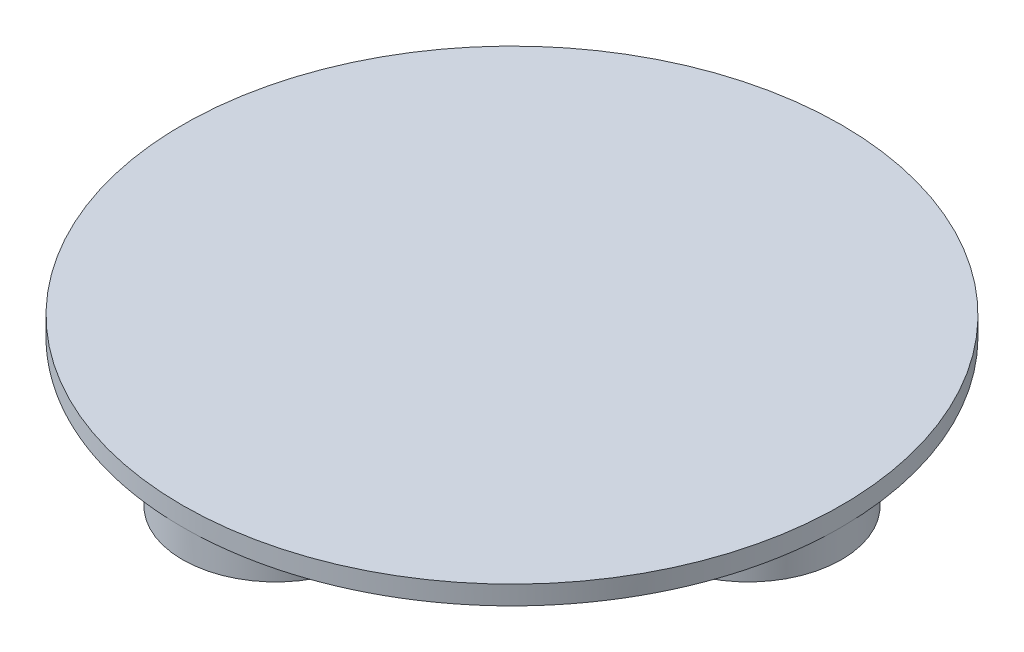
ISO-10303-21;
HEADER;
FILE_DESCRIPTION(('STEP AP214'),'2;1');
FILE_NAME('part.step','',(''),(''),'','','');
FILE_SCHEMA(('AUTOMOTIVE_DESIGN { 1 0 10303 214 1 1 1 1 }'));
ENDSEC;
DATA;
#1=APPLICATION_CONTEXT('core data for automotive mechanical design processes');
#2=APPLICATION_PROTOCOL_DEFINITION('international standard','automotive_design',2000,#1);
#3=PRODUCT_CONTEXT('',#1,'mechanical');
#4=PRODUCT('Part','Part','',(#3));
#5=PRODUCT_RELATED_PRODUCT_CATEGORY('part','',(#4));
#6=PRODUCT_DEFINITION_FORMATION('','',#4);
#7=PRODUCT_DEFINITION_CONTEXT('part definition',#1,'design');
#8=PRODUCT_DEFINITION('design','',#6,#7);
#9=PRODUCT_DEFINITION_SHAPE('','',#8);
#10=(LENGTH_UNIT() NAMED_UNIT(*) SI_UNIT(.MILLI.,.METRE.));
#11=(NAMED_UNIT(*) PLANE_ANGLE_UNIT() SI_UNIT($,.RADIAN.));
#12=(NAMED_UNIT(*) SI_UNIT($,.STERADIAN.) SOLID_ANGLE_UNIT());
#13=UNCERTAINTY_MEASURE_WITH_UNIT(LENGTH_MEASURE(1.E-05),#10,'distance_accuracy_value','');
#14=(GEOMETRIC_REPRESENTATION_CONTEXT(3) GLOBAL_UNCERTAINTY_ASSIGNED_CONTEXT((#13)) GLOBAL_UNIT_ASSIGNED_CONTEXT((#10,
#11,#12)) REPRESENTATION_CONTEXT('',''));
#15=CARTESIAN_POINT('',(0.,0.,0.));
#16=DIRECTION('',(0.,0.,1.));
#17=DIRECTION('',(1.,0.,0.));
#18=AXIS2_PLACEMENT_3D('',#15,#16,#17);
#19=CARTESIAN_POINT('',(0.,2.,0.));
#20=DIRECTION('',(0.,-1.,0.));
#21=DIRECTION('',(0.,0.,-1.));
#22=AXIS2_PLACEMENT_3D('',#19,#20,#21);
#23=CYLINDRICAL_SURFACE('',#22,35.);
#24=CARTESIAN_POINT('',(0.,2.,0.));
#25=DIRECTION('',(0.,1.,0.));
#26=DIRECTION('',(0.,0.,1.));
#27=AXIS2_PLACEMENT_3D('',#24,#25,#26);
#28=CIRCLE('',#27,35.);
#29=CARTESIAN_POINT('',(0.,2.,35.));
#30=VERTEX_POINT('',#29);
#31=EDGE_CURVE('E11',#30,#30,#28,.T.);
#32=ORIENTED_EDGE('',*,*,#31,.F.);
#33=EDGE_LOOP('',(#32));
#34=FACE_BOUND('',#33,.T.);
#35=CARTESIAN_POINT('',(0.,0.,0.));
#36=DIRECTION('',(0.,1.,0.));
#37=DIRECTION('',(0.,0.,1.));
#38=AXIS2_PLACEMENT_3D('',#35,#36,#37);
#39=CIRCLE('',#38,35.);
#40=CARTESIAN_POINT('',(35.,0.,0.));
#41=VERTEX_POINT('',#40);
#42=CARTESIAN_POINT('',(0.,0.,-35.));
#43=VERTEX_POINT('',#42);
#44=EDGE_CURVE('E40',#41,#43,#39,.T.);
#45=ORIENTED_EDGE('',*,*,#44,.T.);
#46=CARTESIAN_POINT('',(-35.,0.,0.));
#47=VERTEX_POINT('',#46);
#48=EDGE_CURVE('E61',#43,#47,#39,.T.);
#49=ORIENTED_EDGE('',*,*,#48,.T.);
#50=CARTESIAN_POINT('',(0.,0.,35.));
#51=VERTEX_POINT('',#50);
#52=EDGE_CURVE('E60',#47,#51,#39,.T.);
#53=ORIENTED_EDGE('',*,*,#52,.T.);
#54=EDGE_CURVE('E51',#51,#41,#39,.T.);
#55=ORIENTED_EDGE('',*,*,#54,.T.);
#56=EDGE_LOOP('',(#45,#49,#53,#55));
#57=FACE_BOUND('',#56,.T.);
#58=ADVANCED_FACE('F37',(#34,#57),#23,.T.);
#59=CARTESIAN_POINT('',(0.,2.,0.));
#60=DIRECTION('',(0.,1.,0.));
#61=DIRECTION('',(0.,0.,1.));
#62=AXIS2_PLACEMENT_3D('',#59,#60,#61);
#63=PLANE('',#62);
#64=ORIENTED_EDGE('',*,*,#31,.T.);
#65=EDGE_LOOP('',(#64));
#66=FACE_BOUND('',#65,.T.);
#67=ADVANCED_FACE('F111',(#66),#63,.T.);
#68=CARTESIAN_POINT('',(0.,0.,0.));
#69=DIRECTION('',(0.,1.,0.));
#70=DIRECTION('',(0.,0.,1.));
#71=AXIS2_PLACEMENT_3D('',#68,#69,#70);
#72=PLANE('',#71);
#73=ORIENTED_EDGE('',*,*,#54,.F.);
#74=CARTESIAN_POINT('',(0.,0.,25.1));
#75=DIRECTION('',(0.,-1.,0.));
#76=DIRECTION('',(0.,0.,-1.));
#77=AXIS2_PLACEMENT_3D('',#74,#75,#76);
#78=CIRCLE('',#77,9.9);
#79=EDGE_CURVE('E68',#51,#51,#78,.T.);
#80=ORIENTED_EDGE('',*,*,#79,.F.);
#81=ORIENTED_EDGE('',*,*,#52,.F.);
#82=CARTESIAN_POINT('',(-25.1,0.,0.));
#83=DIRECTION('',(0.,-1.,0.));
#84=DIRECTION('',(0.,0.,-1.));
#85=AXIS2_PLACEMENT_3D('',#82,#83,#84);
#86=CIRCLE('',#85,9.9);
#87=EDGE_CURVE('E82',#47,#47,#86,.T.);
#88=ORIENTED_EDGE('',*,*,#87,.F.);
#89=ORIENTED_EDGE('',*,*,#48,.F.);
#90=CARTESIAN_POINT('',(0.,0.,-25.1));
#91=DIRECTION('',(0.,-1.,0.));
#92=DIRECTION('',(0.,0.,-1.));
#93=AXIS2_PLACEMENT_3D('',#90,#91,#92);
#94=CIRCLE('',#93,9.9);
#95=EDGE_CURVE('E76',#43,#43,#94,.T.);
#96=ORIENTED_EDGE('',*,*,#95,.F.);
#97=ORIENTED_EDGE('',*,*,#44,.F.);
#98=CARTESIAN_POINT('',(25.1,0.,0.));
#99=DIRECTION('',(0.,-1.,0.));
#100=DIRECTION('',(0.,0.,-1.));
#101=AXIS2_PLACEMENT_3D('',#98,#99,#100);
#102=CIRCLE('',#101,9.9);
#103=EDGE_CURVE('E70',#41,#41,#102,.T.);
#104=ORIENTED_EDGE('',*,*,#103,.F.);
#105=EDGE_LOOP('',(#73,#80,#81,#88,#89,#96,#97,#104));
#106=FACE_BOUND('',#105,.T.);
#107=ADVANCED_FACE('F66',(#106),#72,.F.);
#108=CARTESIAN_POINT('',(25.1,-3.,0.));
#109=DIRECTION('',(0.,1.,0.));
#110=DIRECTION('',(0.,0.,1.));
#111=AXIS2_PLACEMENT_3D('',#108,#109,#110);
#112=CYLINDRICAL_SURFACE('',#111,9.9);
#113=CARTESIAN_POINT('',(25.1,-3.,0.));
#114=DIRECTION('',(0.,-1.,0.));
#115=DIRECTION('',(0.,0.,-1.));
#116=AXIS2_PLACEMENT_3D('',#113,#114,#115);
#117=CIRCLE('',#116,9.9);
#118=CARTESIAN_POINT('',(25.1,-3.,-9.9));
#119=VERTEX_POINT('',#118);
#120=EDGE_CURVE('E71',#119,#119,#117,.T.);
#121=ORIENTED_EDGE('',*,*,#120,.F.);
#122=EDGE_LOOP('',(#121));
#123=FACE_BOUND('',#122,.T.);
#124=ORIENTED_EDGE('',*,*,#103,.T.);
#125=EDGE_LOOP('',(#124));
#126=FACE_BOUND('',#125,.T.);
#127=ADVANCED_FACE('F122',(#123,#126),#112,.T.);
#128=CARTESIAN_POINT('',(25.1,-3.,0.));
#129=DIRECTION('',(0.,-1.,0.));
#130=DIRECTION('',(0.,0.,-1.));
#131=AXIS2_PLACEMENT_3D('',#128,#129,#130);
#132=PLANE('',#131);
#133=ORIENTED_EDGE('',*,*,#120,.T.);
#134=EDGE_LOOP('',(#133));
#135=FACE_BOUND('',#134,.T.);
#136=ADVANCED_FACE('F126',(#135),#132,.T.);
#137=CARTESIAN_POINT('',(0.,-3.,-25.1));
#138=DIRECTION('',(0.,1.,0.));
#139=DIRECTION('',(0.,0.,1.));
#140=AXIS2_PLACEMENT_3D('',#137,#138,#139);
#141=CYLINDRICAL_SURFACE('',#140,9.9);
#142=CARTESIAN_POINT('',(0.,-3.,-25.1));
#143=DIRECTION('',(0.,-1.,0.));
#144=DIRECTION('',(0.,0.,-1.));
#145=AXIS2_PLACEMENT_3D('',#142,#143,#144);
#146=CIRCLE('',#145,9.9);
#147=CARTESIAN_POINT('',(0.,-3.,-35.));
#148=VERTEX_POINT('',#147);
#149=EDGE_CURVE('E79',#148,#148,#146,.T.);
#150=ORIENTED_EDGE('',*,*,#149,.F.);
#151=EDGE_LOOP('',(#150));
#152=FACE_BOUND('',#151,.T.);
#153=ORIENTED_EDGE('',*,*,#95,.T.);
#154=EDGE_LOOP('',(#153));
#155=FACE_BOUND('',#154,.T.);
#156=ADVANCED_FACE('F130',(#152,#155),#141,.T.);
#157=CARTESIAN_POINT('',(0.,-3.,-25.1));
#158=DIRECTION('',(0.,-1.,0.));
#159=DIRECTION('',(0.,0.,-1.));
#160=AXIS2_PLACEMENT_3D('',#157,#158,#159);
#161=PLANE('',#160);
#162=ORIENTED_EDGE('',*,*,#149,.T.);
#163=EDGE_LOOP('',(#162));
#164=FACE_BOUND('',#163,.T.);
#165=ADVANCED_FACE('F131',(#164),#161,.T.);
#166=CARTESIAN_POINT('',(-25.1,-3.,0.));
#167=DIRECTION('',(0.,1.,0.));
#168=DIRECTION('',(0.,0.,1.));
#169=AXIS2_PLACEMENT_3D('',#166,#167,#168);
#170=CYLINDRICAL_SURFACE('',#169,9.9);
#171=CARTESIAN_POINT('',(-25.1,-3.,0.));
#172=DIRECTION('',(0.,-1.,0.));
#173=DIRECTION('',(0.,0.,-1.));
#174=AXIS2_PLACEMENT_3D('',#171,#172,#173);
#175=CIRCLE('',#174,9.9);
#176=CARTESIAN_POINT('',(-25.1,-3.,-9.9));
#177=VERTEX_POINT('',#176);
#178=EDGE_CURVE('E85',#177,#177,#175,.T.);
#179=ORIENTED_EDGE('',*,*,#178,.F.);
#180=EDGE_LOOP('',(#179));
#181=FACE_BOUND('',#180,.T.);
#182=ORIENTED_EDGE('',*,*,#87,.T.);
#183=EDGE_LOOP('',(#182));
#184=FACE_BOUND('',#183,.T.);
#185=ADVANCED_FACE('F106',(#181,#184),#170,.T.);
#186=CARTESIAN_POINT('',(-25.1,-3.,0.));
#187=DIRECTION('',(0.,-1.,0.));
#188=DIRECTION('',(0.,0.,-1.));
#189=AXIS2_PLACEMENT_3D('',#186,#187,#188);
#190=PLANE('',#189);
#191=ORIENTED_EDGE('',*,*,#178,.T.);
#192=EDGE_LOOP('',(#191));
#193=FACE_BOUND('',#192,.T.);
#194=ADVANCED_FACE('F97',(#193),#190,.T.);
#195=CARTESIAN_POINT('',(0.,-3.,25.1));
#196=DIRECTION('',(0.,1.,0.));
#197=DIRECTION('',(0.,0.,1.));
#198=AXIS2_PLACEMENT_3D('',#195,#196,#197);
#199=CYLINDRICAL_SURFACE('',#198,9.9);
#200=CARTESIAN_POINT('',(0.,-3.,25.1));
#201=DIRECTION('',(0.,-1.,0.));
#202=DIRECTION('',(0.,0.,-1.));
#203=AXIS2_PLACEMENT_3D('',#200,#201,#202);
#204=CIRCLE('',#203,9.9);
#205=CARTESIAN_POINT('',(0.,-3.,15.2));
#206=VERTEX_POINT('',#205);
#207=EDGE_CURVE('E90',#206,#206,#204,.T.);
#208=ORIENTED_EDGE('',*,*,#207,.F.);
#209=EDGE_LOOP('',(#208));
#210=FACE_BOUND('',#209,.T.);
#211=ORIENTED_EDGE('',*,*,#79,.T.);
#212=EDGE_LOOP('',(#211));
#213=FACE_BOUND('',#212,.T.);
#214=ADVANCED_FACE('F94',(#210,#213),#199,.T.);
#215=CARTESIAN_POINT('',(0.,-3.,25.1));
#216=DIRECTION('',(0.,-1.,0.));
#217=DIRECTION('',(0.,0.,-1.));
#218=AXIS2_PLACEMENT_3D('',#215,#216,#217);
#219=PLANE('',#218);
#220=ORIENTED_EDGE('',*,*,#207,.T.);
#221=EDGE_LOOP('',(#220));
#222=FACE_BOUND('',#221,.T.);
#223=ADVANCED_FACE('F96',(#222),#219,.T.);
#224=CLOSED_SHELL('',(#58,#67,#107,#127,#136,#156,#165,#185,#194,#214,#223));
#225=MANIFOLD_SOLID_BREP('B2',#224);
#226=ADVANCED_BREP_SHAPE_REPRESENTATION('',(#18,#225),#14);
#227=SHAPE_DEFINITION_REPRESENTATION(#9,#226);
ENDSEC;
END-ISO-10303-21;
